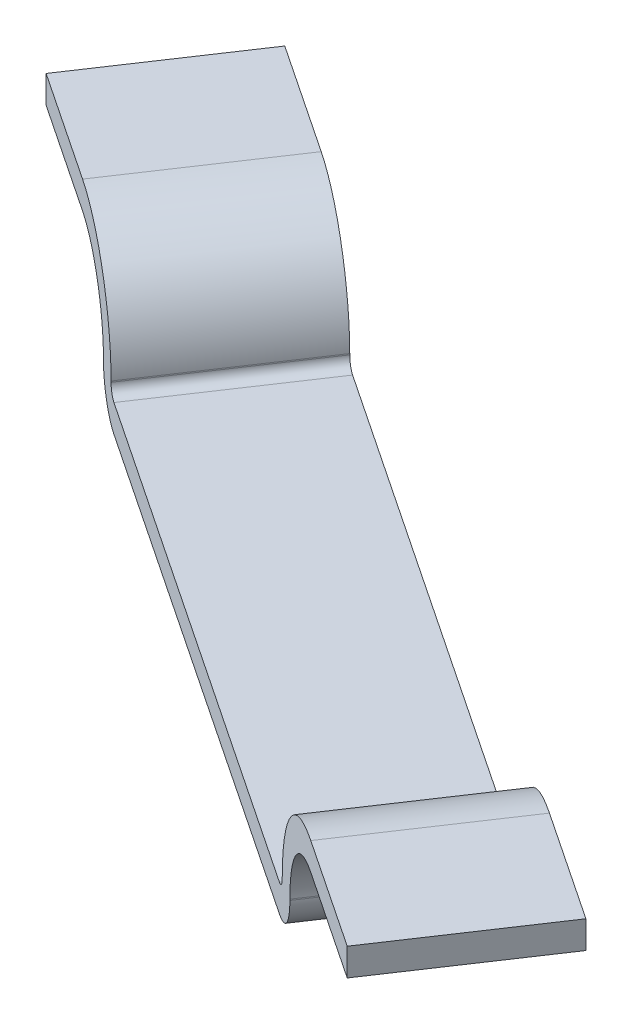
ISO-10303-21;
HEADER;
FILE_DESCRIPTION(('STEP AP214'),'2;1');
FILE_NAME('part.step','',(''),(''),'','','');
FILE_SCHEMA(('AUTOMOTIVE_DESIGN { 1 0 10303 214 1 1 1 1 }'));
ENDSEC;
DATA;
#1=APPLICATION_CONTEXT('core data for automotive mechanical design processes');
#2=APPLICATION_PROTOCOL_DEFINITION('international standard','automotive_design',2000,#1);
#3=PRODUCT_CONTEXT('',#1,'mechanical');
#4=PRODUCT('Part','Part','',(#3));
#5=PRODUCT_RELATED_PRODUCT_CATEGORY('part','',(#4));
#6=PRODUCT_DEFINITION_FORMATION('','',#4);
#7=PRODUCT_DEFINITION_CONTEXT('part definition',#1,'design');
#8=PRODUCT_DEFINITION('design','',#6,#7);
#9=PRODUCT_DEFINITION_SHAPE('','',#8);
#10=(LENGTH_UNIT() NAMED_UNIT(*) SI_UNIT(.MILLI.,.METRE.));
#11=(NAMED_UNIT(*) PLANE_ANGLE_UNIT() SI_UNIT($,.RADIAN.));
#12=(NAMED_UNIT(*) SI_UNIT($,.STERADIAN.) SOLID_ANGLE_UNIT());
#13=UNCERTAINTY_MEASURE_WITH_UNIT(LENGTH_MEASURE(1.E-05),#10,'distance_accuracy_value','');
#14=(GEOMETRIC_REPRESENTATION_CONTEXT(3) GLOBAL_UNCERTAINTY_ASSIGNED_CONTEXT((#13)) GLOBAL_UNIT_ASSIGNED_CONTEXT((#10,
#11,#12)) REPRESENTATION_CONTEXT('',''));
#15=CARTESIAN_POINT('',(0.,0.,0.));
#16=DIRECTION('',(0.,0.,1.));
#17=DIRECTION('',(1.,0.,0.));
#18=AXIS2_PLACEMENT_3D('',#15,#16,#17);
#19=CARTESIAN_POINT('',(-63.4705789838044,293.912651075744,-75.0206461074792));
#20=DIRECTION('',(-0.831624490182753,0.,-0.555338371921368));
#21=DIRECTION('',(-0.555338371921368,0.,0.831624490182753));
#22=AXIS2_PLACEMENT_3D('',#19,#20,#21);
#23=PLANE('',#22);
#24=DIRECTION('',(0.,-1.,0.));
#25=VECTOR('',#24,1.);
#26=CARTESIAN_POINT('',(-59.3055411943941,293.912651075744,-81.2578297838499));
#27=LINE('',#26,#25);
#28=CARTESIAN_POINT('',(-59.3055411943941,293.912651075744,-81.2578297838499));
#29=VERTEX_POINT('',#28);
#30=CARTESIAN_POINT('',(-59.3055411943941,292.712651075744,-81.2578297838499));
#31=VERTEX_POINT('',#30);
#32=EDGE_CURVE('E11',#29,#31,#27,.T.);
#33=ORIENTED_EDGE('',*,*,#32,.T.);
#34=DIRECTION('',(0.555338371921368,0.,-0.831624490182753));
#35=VECTOR('',#34,1.);
#36=CARTESIAN_POINT('',(-63.4705789838044,292.712651075744,-75.0206461074792));
#37=LINE('',#36,#35);
#38=CARTESIAN_POINT('',(-63.4705789838044,292.712651075744,-75.0206461074792));
#39=VERTEX_POINT('',#38);
#40=EDGE_CURVE('E37',#39,#31,#37,.T.);
#41=ORIENTED_EDGE('',*,*,#40,.F.);
#42=DIRECTION('',(0.,-1.,0.));
#43=VECTOR('',#42,1.);
#44=CARTESIAN_POINT('',(-63.4705789838044,293.912651075744,-75.0206461074792));
#45=LINE('',#44,#43);
#46=CARTESIAN_POINT('',(-63.4705789838044,293.912651075744,-75.0206461074792));
#47=VERTEX_POINT('',#46);
#48=EDGE_CURVE('E335',#47,#39,#45,.T.);
#49=ORIENTED_EDGE('',*,*,#48,.F.);
#50=DIRECTION('',(0.555338371921368,0.,-0.831624490182753));
#51=VECTOR('',#50,1.);
#52=CARTESIAN_POINT('',(-63.4705789838044,293.912651075744,-75.0206461074792));
#53=LINE('',#52,#51);
#54=EDGE_CURVE('E28',#47,#29,#53,.T.);
#55=ORIENTED_EDGE('',*,*,#54,.T.);
#56=EDGE_LOOP('',(#33,#41,#49,#55));
#57=FACE_BOUND('',#56,.T.);
#58=ADVANCED_FACE('F17',(#57),#23,.T.);
#59=CARTESIAN_POINT('',(-23.9684157001236,293.912651075744,-48.6420734412142));
#60=DIRECTION('',(-0.555338371921368,0.,0.831624490182753));
#61=DIRECTION('',(0.831624490182753,0.,0.555338371921368));
#62=AXIS2_PLACEMENT_3D('',#59,#60,#61);
#63=PLANE('',#62);
#64=DIRECTION('',(-0.831624490182753,0.,-0.555338371921368));
#65=VECTOR('',#64,1.);
#66=CARTESIAN_POINT('',(-23.9684157001236,293.912651075744,-48.6420734412142));
#67=LINE('',#66,#65);
#68=CARTESIAN_POINT('',(-23.9684157001236,293.912651075744,-48.6420734412142));
#69=VERTEX_POINT('',#68);
#70=CARTESIAN_POINT('',(-28.7502565186744,293.912651075744,-51.8352690797621));
#71=VERTEX_POINT('',#70);
#72=EDGE_CURVE('E443',#69,#71,#67,.T.);
#73=ORIENTED_EDGE('',*,*,#72,.T.);
#74=CARTESIAN_POINT('',(-28.7502565186744,289.412651075744,-51.8352690797621));
#75=DIRECTION('',(-0.555338371921368,0.,0.831624490182753));
#76=DIRECTION('',(0.831624490182754,0.,0.555338371921368));
#77=AXIS2_PLACEMENT_3D('',#74,#75,#76);
#78=CIRCLE('',#77,4.5);
#79=CARTESIAN_POINT('',(-32.4925667244968,289.412651075744,-54.3342917534083));
#80=VERTEX_POINT('',#79);
#81=EDGE_CURVE('E439',#71,#80,#78,.T.);
#82=ORIENTED_EDGE('',*,*,#81,.T.);
#83=DIRECTION('',(0.,-1.,0.));
#84=VECTOR('',#83,1.);
#85=CARTESIAN_POINT('',(-32.4925667244968,289.412651075744,-54.3342917534083));
#86=LINE('',#85,#84);
#87=CARTESIAN_POINT('',(-32.4925667244968,289.362651075744,-54.3342917534083));
#88=VERTEX_POINT('',#87);
#89=EDGE_CURVE('E436',#80,#88,#86,.T.);
#90=ORIENTED_EDGE('',*,*,#89,.T.);
#91=CARTESIAN_POINT('',(-32.8667977450791,289.362651075744,-54.5841940207729));
#92=DIRECTION('',(0.555338371921368,0.,-0.831624490182753));
#93=DIRECTION('',(0.831624490182754,0.,0.555338371921368));
#94=AXIS2_PLACEMENT_3D('',#91,#92,#93);
#95=CIRCLE('',#94,0.45);
#96=CARTESIAN_POINT('',(-32.8667977450791,288.912651075744,-54.5841940207729));
#97=VERTEX_POINT('',#96);
#98=EDGE_CURVE('E175',#88,#97,#95,.T.);
#99=ORIENTED_EDGE('',*,*,#98,.T.);
#100=DIRECTION('',(-0.831624490182753,0.,-0.555338371921368));
#101=VECTOR('',#100,1.);
#102=CARTESIAN_POINT('',(-32.8667977450791,288.912651075744,-54.5841940207729));
#103=LINE('',#102,#101);
#104=CARTESIAN_POINT('',(-54.5721969388489,288.912651075744,-69.0785255279206));
#105=VERTEX_POINT('',#104);
#106=EDGE_CURVE('E430',#97,#105,#103,.T.);
#107=ORIENTED_EDGE('',*,*,#106,.T.);
#108=CARTESIAN_POINT('',(-54.5721969388489,289.362651075744,-69.0785255279206));
#109=DIRECTION('',(0.555338371921368,0.,-0.831624490182753));
#110=DIRECTION('',(0.831624490182754,0.,0.555338371921368));
#111=AXIS2_PLACEMENT_3D('',#108,#109,#110);
#112=CIRCLE('',#111,0.45);
#113=CARTESIAN_POINT('',(-54.9464279594312,289.362651075744,-69.3284277952852));
#114=VERTEX_POINT('',#113);
#115=EDGE_CURVE('E426',#105,#114,#112,.T.);
#116=ORIENTED_EDGE('',*,*,#115,.T.);
#117=DIRECTION('',(0.,1.,0.));
#118=VECTOR('',#117,1.);
#119=CARTESIAN_POINT('',(-54.9464279594312,289.362651075744,-69.3284277952852));
#120=LINE('',#119,#118);
#121=CARTESIAN_POINT('',(-54.9464279594312,289.412651075744,-69.3284277952852));
#122=VERTEX_POINT('',#121);
#123=EDGE_CURVE('E422',#114,#122,#120,.T.);
#124=ORIENTED_EDGE('',*,*,#123,.T.);
#125=CARTESIAN_POINT('',(-58.6887381652536,289.412651075744,-71.8274504689314));
#126=DIRECTION('',(-0.555338371921368,0.,0.831624490182753));
#127=DIRECTION('',(0.831624490182754,0.,0.555338371921368));
#128=AXIS2_PLACEMENT_3D('',#125,#126,#127);
#129=CIRCLE('',#128,4.5);
#130=CARTESIAN_POINT('',(-58.6887381652536,293.912651075744,-71.8274504689314));
#131=VERTEX_POINT('',#130);
#132=EDGE_CURVE('E418',#122,#131,#129,.T.);
#133=ORIENTED_EDGE('',*,*,#132,.T.);
#134=DIRECTION('',(-0.831624490182753,0.,-0.555338371921368));
#135=VECTOR('',#134,1.);
#136=CARTESIAN_POINT('',(-58.6887381652536,293.912651075744,-71.8274504689314));
#137=LINE('',#136,#135);
#138=EDGE_CURVE('E386',#131,#47,#137,.T.);
#139=ORIENTED_EDGE('',*,*,#138,.T.);
#140=ORIENTED_EDGE('',*,*,#48,.T.);
#141=DIRECTION('',(-0.831624490182753,0.,-0.555338371921368));
#142=VECTOR('',#141,1.);
#143=CARTESIAN_POINT('',(-58.6887381652536,292.712651075744,-71.8274504689314));
#144=LINE('',#143,#142);
#145=CARTESIAN_POINT('',(-58.6887381652536,292.712651075744,-71.8274504689314));
#146=VERTEX_POINT('',#145);
#147=EDGE_CURVE('E266',#146,#39,#144,.T.);
#148=ORIENTED_EDGE('',*,*,#147,.F.);
#149=CARTESIAN_POINT('',(-58.6887381652536,289.412651075744,-71.8274504689314));
#150=DIRECTION('',(-0.555338371921368,0.,0.831624490182753));
#151=DIRECTION('',(-0.831624490182754,0.,-0.555338371921368));
#152=AXIS2_PLACEMENT_3D('',#149,#150,#151);
#153=CIRCLE('',#152,3.3);
#154=CARTESIAN_POINT('',(-55.9443773476505,289.412651075744,-69.9948338415908));
#155=VERTEX_POINT('',#154);
#156=EDGE_CURVE('E262',#155,#146,#153,.T.);
#157=ORIENTED_EDGE('',*,*,#156,.F.);
#158=DIRECTION('',(0.,1.,0.));
#159=VECTOR('',#158,1.);
#160=CARTESIAN_POINT('',(-55.9443773476505,289.362651075744,-69.9948338415908));
#161=LINE('',#160,#159);
#162=CARTESIAN_POINT('',(-55.9443773476505,289.362651075744,-69.9948338415908));
#163=VERTEX_POINT('',#162);
#164=EDGE_CURVE('E257',#163,#155,#161,.T.);
#165=ORIENTED_EDGE('',*,*,#164,.F.);
#166=CARTESIAN_POINT('',(-54.5721969388489,289.362651075744,-69.0785255279206));
#167=DIRECTION('',(0.555338371921368,0.,-0.831624490182753));
#168=DIRECTION('',(-0.831624490182754,0.,-0.555338371921368));
#169=AXIS2_PLACEMENT_3D('',#166,#167,#168);
#170=CIRCLE('',#169,1.65);
#171=CARTESIAN_POINT('',(-54.5721969388489,287.712651075744,-69.0785255279206));
#172=VERTEX_POINT('',#171);
#173=EDGE_CURVE('E252',#172,#163,#170,.T.);
#174=ORIENTED_EDGE('',*,*,#173,.F.);
#175=DIRECTION('',(-0.831624490182753,0.,-0.555338371921368));
#176=VECTOR('',#175,1.);
#177=CARTESIAN_POINT('',(-32.8667977450791,287.712651075744,-54.5841940207729));
#178=LINE('',#177,#176);
#179=CARTESIAN_POINT('',(-32.8667977450791,287.712651075744,-54.5841940207729));
#180=VERTEX_POINT('',#179);
#181=EDGE_CURVE('E247',#180,#172,#178,.T.);
#182=ORIENTED_EDGE('',*,*,#181,.F.);
#183=CARTESIAN_POINT('',(-32.8667977450791,289.362651075744,-54.5841940207729));
#184=DIRECTION('',(0.555338371921368,0.,-0.831624490182753));
#185=DIRECTION('',(-0.831624490182754,0.,-0.555338371921368));
#186=AXIS2_PLACEMENT_3D('',#183,#184,#185);
#187=CIRCLE('',#186,1.65);
#188=CARTESIAN_POINT('',(-31.4946173362775,289.362651075744,-53.6678857071026));
#189=VERTEX_POINT('',#188);
#190=EDGE_CURVE('E242',#189,#180,#187,.T.);
#191=ORIENTED_EDGE('',*,*,#190,.F.);
#192=DIRECTION('',(0.,-1.,0.));
#193=VECTOR('',#192,1.);
#194=CARTESIAN_POINT('',(-31.4946173362775,289.412651075744,-53.6678857071026));
#195=LINE('',#194,#193);
#196=CARTESIAN_POINT('',(-31.4946173362775,289.412651075744,-53.6678857071026));
#197=VERTEX_POINT('',#196);
#198=EDGE_CURVE('E237',#197,#189,#195,.T.);
#199=ORIENTED_EDGE('',*,*,#198,.F.);
#200=CARTESIAN_POINT('',(-28.7502565186744,289.412651075744,-51.8352690797621));
#201=DIRECTION('',(-0.555338371921368,0.,0.831624490182753));
#202=DIRECTION('',(-0.831624490182754,0.,-0.555338371921368));
#203=AXIS2_PLACEMENT_3D('',#200,#201,#202);
#204=CIRCLE('',#203,3.3);
#205=CARTESIAN_POINT('',(-28.7502565186744,292.712651075744,-51.8352690797621));
#206=VERTEX_POINT('',#205);
#207=EDGE_CURVE('E232',#206,#197,#204,.T.);
#208=ORIENTED_EDGE('',*,*,#207,.F.);
#209=DIRECTION('',(-0.831624490182753,0.,-0.555338371921368));
#210=VECTOR('',#209,1.);
#211=CARTESIAN_POINT('',(-23.9684157001236,292.712651075744,-48.6420734412142));
#212=LINE('',#211,#210);
#213=CARTESIAN_POINT('',(-23.9684157001236,292.712651075744,-48.6420734412142));
#214=VERTEX_POINT('',#213);
#215=EDGE_CURVE('E231',#214,#206,#212,.T.);
#216=ORIENTED_EDGE('',*,*,#215,.F.);
#217=DIRECTION('',(0.,-1.,0.));
#218=VECTOR('',#217,1.);
#219=CARTESIAN_POINT('',(-23.9684157001236,293.912651075744,-48.6420734412142));
#220=LINE('',#219,#218);
#221=EDGE_CURVE('E331',#69,#214,#220,.T.);
#222=ORIENTED_EDGE('',*,*,#221,.F.);
#223=EDGE_LOOP('',(#73,#82,#90,#99,#107,#116,#124,#133,#139,#140,#148,#157,#165,#174,#182,#191,
#199,#208,#216,#222));
#224=FACE_BOUND('',#223,.T.);
#225=ADVANCED_FACE('F452',(#224),#63,.T.);
#226=CARTESIAN_POINT('',(-23.9684157001236,293.912651075744,-48.6420734412142));
#227=DIRECTION('',(-0.831624490182753,0.,-0.555338371921368));
#228=DIRECTION('',(-0.555338371921368,0.,0.831624490182753));
#229=AXIS2_PLACEMENT_3D('',#226,#227,#228);
#230=PLANE('',#229);
#231=ORIENTED_EDGE('',*,*,#221,.T.);
#232=DIRECTION('',(0.555338371921368,0.,-0.831624490182753));
#233=VECTOR('',#232,1.);
#234=CARTESIAN_POINT('',(-23.9684157001236,292.712651075744,-48.6420734412142));
#235=LINE('',#234,#233);
#236=CARTESIAN_POINT('',(-19.8033779107134,292.712651075744,-54.8792571175849));
#237=VERTEX_POINT('',#236);
#238=EDGE_CURVE('E336',#214,#237,#235,.T.);
#239=ORIENTED_EDGE('',*,*,#238,.T.);
#240=DIRECTION('',(0.,-1.,0.));
#241=VECTOR('',#240,1.);
#242=CARTESIAN_POINT('',(-19.8033779107134,293.912651075744,-54.8792571175849));
#243=LINE('',#242,#241);
#244=CARTESIAN_POINT('',(-19.8033779107134,293.912651075744,-54.8792571175849));
#245=VERTEX_POINT('',#244);
#246=EDGE_CURVE('E289',#245,#237,#243,.T.);
#247=ORIENTED_EDGE('',*,*,#246,.F.);
#248=DIRECTION('',(0.555338371921368,0.,-0.831624490182753));
#249=VECTOR('',#248,1.);
#250=CARTESIAN_POINT('',(-23.9684157001236,293.912651075744,-48.6420734412142));
#251=LINE('',#250,#249);
#252=EDGE_CURVE('E274',#69,#245,#251,.T.);
#253=ORIENTED_EDGE('',*,*,#252,.F.);
#254=EDGE_LOOP('',(#231,#239,#247,#253));
#255=FACE_BOUND('',#254,.T.);
#256=ADVANCED_FACE('F346',(#255),#230,.F.);
#257=CARTESIAN_POINT('',(-24.5852187292642,289.412651075744,-58.0724527561328));
#258=DIRECTION('',(0.555338371921368,0.,-0.831624490182753));
#259=DIRECTION('',(0.831624490182753,0.,0.555338371921368));
#260=AXIS2_PLACEMENT_3D('',#257,#258,#259);
#261=PLANE('',#260);
#262=CARTESIAN_POINT('',(-24.5852187292642,289.412651075744,-58.0724527561328));
#263=DIRECTION('',(-0.555338371921368,0.,0.831624490182753));
#264=DIRECTION('',(0.831624490182754,0.,0.555338371921368));
#265=AXIS2_PLACEMENT_3D('',#262,#263,#264);
#266=CIRCLE('',#265,4.5);
#267=CARTESIAN_POINT('',(-24.5852187292642,293.912651075744,-58.0724527561328));
#268=VERTEX_POINT('',#267);
#269=CARTESIAN_POINT('',(-28.3275289350866,289.412651075744,-60.5714754297789));
#270=VERTEX_POINT('',#269);
#271=EDGE_CURVE('E269',#268,#270,#266,.T.);
#272=ORIENTED_EDGE('',*,*,#271,.F.);
#273=DIRECTION('',(-0.831624490182753,0.,-0.555338371921368));
#274=VECTOR('',#273,1.);
#275=CARTESIAN_POINT('',(-19.8033779107134,293.912651075744,-54.8792571175849));
#276=LINE('',#275,#274);
#277=EDGE_CURVE('E278',#245,#268,#276,.T.);
#278=ORIENTED_EDGE('',*,*,#277,.F.);
#279=ORIENTED_EDGE('',*,*,#246,.T.);
#280=DIRECTION('',(-0.831624490182753,0.,-0.555338371921368));
#281=VECTOR('',#280,1.);
#282=CARTESIAN_POINT('',(-19.8033779107134,292.712651075744,-54.8792571175849));
#283=LINE('',#282,#281);
#284=CARTESIAN_POINT('',(-24.5852187292642,292.712651075744,-58.0724527561328));
#285=VERTEX_POINT('',#284);
#286=EDGE_CURVE('E285',#237,#285,#283,.T.);
#287=ORIENTED_EDGE('',*,*,#286,.T.);
#288=CARTESIAN_POINT('',(-24.5852187292642,289.412651075744,-58.0724527561328));
#289=DIRECTION('',(-0.555338371921368,0.,0.831624490182753));
#290=DIRECTION('',(-0.831624490182754,0.,-0.555338371921368));
#291=AXIS2_PLACEMENT_3D('',#288,#289,#290);
#292=CIRCLE('',#291,3.3);
#293=CARTESIAN_POINT('',(-27.3295795468673,289.412651075744,-59.9050693834733));
#294=VERTEX_POINT('',#293);
#295=EDGE_CURVE('E290',#285,#294,#292,.T.);
#296=ORIENTED_EDGE('',*,*,#295,.T.);
#297=DIRECTION('',(0.,-1.,0.));
#298=VECTOR('',#297,1.);
#299=CARTESIAN_POINT('',(-27.3295795468673,289.412651075744,-59.9050693834733));
#300=LINE('',#299,#298);
#301=CARTESIAN_POINT('',(-27.3295795468673,289.362651075744,-59.9050693834733));
#302=VERTEX_POINT('',#301);
#303=EDGE_CURVE('E294',#294,#302,#300,.T.);
#304=ORIENTED_EDGE('',*,*,#303,.T.);
#305=CARTESIAN_POINT('',(-28.7017599556688,289.362651075744,-60.8213776971435));
#306=DIRECTION('',(0.555338371921368,0.,-0.831624490182753));
#307=DIRECTION('',(-0.831624490182754,0.,-0.555338371921368));
#308=AXIS2_PLACEMENT_3D('',#305,#306,#307);
#309=CIRCLE('',#308,1.65);
#310=CARTESIAN_POINT('',(-28.7017599556688,287.712651075744,-60.8213776971435));
#311=VERTEX_POINT('',#310);
#312=EDGE_CURVE('E298',#302,#311,#309,.T.);
#313=ORIENTED_EDGE('',*,*,#312,.T.);
#314=DIRECTION('',(-0.831624490182753,0.,-0.555338371921368));
#315=VECTOR('',#314,1.);
#316=CARTESIAN_POINT('',(-28.7017599556688,287.712651075744,-60.8213776971435));
#317=LINE('',#316,#315);
#318=CARTESIAN_POINT('',(-50.4071591494387,287.712651075744,-75.3157092042912));
#319=VERTEX_POINT('',#318);
#320=EDGE_CURVE('E302',#311,#319,#317,.T.);
#321=ORIENTED_EDGE('',*,*,#320,.T.);
#322=CARTESIAN_POINT('',(-50.4071591494387,289.362651075744,-75.3157092042912));
#323=DIRECTION('',(0.555338371921368,0.,-0.831624490182753));
#324=DIRECTION('',(-0.831624490182754,0.,-0.555338371921368));
#325=AXIS2_PLACEMENT_3D('',#322,#323,#324);
#326=CIRCLE('',#325,1.65);
#327=CARTESIAN_POINT('',(-51.7793395582402,289.362651075744,-76.2320175179615));
#328=VERTEX_POINT('',#327);
#329=EDGE_CURVE('E306',#319,#328,#326,.T.);
#330=ORIENTED_EDGE('',*,*,#329,.T.);
#331=DIRECTION('',(0.,1.,0.));
#332=VECTOR('',#331,1.);
#333=CARTESIAN_POINT('',(-51.7793395582402,289.362651075744,-76.2320175179615));
#334=LINE('',#333,#332);
#335=CARTESIAN_POINT('',(-51.7793395582402,289.412651075744,-76.2320175179615));
#336=VERTEX_POINT('',#335);
#337=EDGE_CURVE('E310',#328,#336,#334,.T.);
#338=ORIENTED_EDGE('',*,*,#337,.T.);
#339=CARTESIAN_POINT('',(-54.5237003758433,289.412651075744,-78.064634145302));
#340=DIRECTION('',(-0.555338371921368,0.,0.831624490182753));
#341=DIRECTION('',(-0.831624490182754,0.,-0.555338371921368));
#342=AXIS2_PLACEMENT_3D('',#339,#340,#341);
#343=CIRCLE('',#342,3.3);
#344=CARTESIAN_POINT('',(-54.5237003758433,292.712651075744,-78.064634145302));
#345=VERTEX_POINT('',#344);
#346=EDGE_CURVE('E313',#336,#345,#343,.T.);
#347=ORIENTED_EDGE('',*,*,#346,.T.);
#348=DIRECTION('',(-0.831624490182753,0.,-0.555338371921368));
#349=VECTOR('',#348,1.);
#350=CARTESIAN_POINT('',(-54.5237003758433,292.712651075744,-78.064634145302));
#351=LINE('',#350,#349);
#352=EDGE_CURVE('E218',#345,#31,#351,.T.);
#353=ORIENTED_EDGE('',*,*,#352,.T.);
#354=ORIENTED_EDGE('',*,*,#32,.F.);
#355=DIRECTION('',(-0.831624490182753,0.,-0.555338371921368));
#356=VECTOR('',#355,1.);
#357=CARTESIAN_POINT('',(-54.5237003758433,293.912651075744,-78.064634145302));
#358=LINE('',#357,#356);
#359=CARTESIAN_POINT('',(-54.5237003758433,293.912651075744,-78.064634145302));
#360=VERTEX_POINT('',#359);
#361=EDGE_CURVE('E202',#360,#29,#358,.T.);
#362=ORIENTED_EDGE('',*,*,#361,.F.);
#363=CARTESIAN_POINT('',(-54.5237003758433,289.412651075744,-78.064634145302));
#364=DIRECTION('',(-0.555338371921368,0.,0.831624490182753));
#365=DIRECTION('',(0.831624490182754,0.,0.555338371921368));
#366=AXIS2_PLACEMENT_3D('',#363,#364,#365);
#367=CIRCLE('',#366,4.5);
#368=CARTESIAN_POINT('',(-50.7813901700209,289.412651075744,-75.5656114716559));
#369=VERTEX_POINT('',#368);
#370=EDGE_CURVE('E198',#369,#360,#367,.T.);
#371=ORIENTED_EDGE('',*,*,#370,.F.);
#372=DIRECTION('',(0.,1.,0.));
#373=VECTOR('',#372,1.);
#374=CARTESIAN_POINT('',(-50.7813901700209,289.362651075744,-75.5656114716559));
#375=LINE('',#374,#373);
#376=CARTESIAN_POINT('',(-50.7813901700209,289.362651075744,-75.5656114716559));
#377=VERTEX_POINT('',#376);
#378=EDGE_CURVE('E194',#377,#369,#375,.T.);
#379=ORIENTED_EDGE('',*,*,#378,.F.);
#380=CARTESIAN_POINT('',(-50.4071591494387,289.362651075744,-75.3157092042912));
#381=DIRECTION('',(0.555338371921368,0.,-0.831624490182753));
#382=DIRECTION('',(0.831624490182754,0.,0.555338371921368));
#383=AXIS2_PLACEMENT_3D('',#380,#381,#382);
#384=CIRCLE('',#383,0.45);
#385=CARTESIAN_POINT('',(-50.4071591494387,288.912651075744,-75.3157092042912));
#386=VERTEX_POINT('',#385);
#387=EDGE_CURVE('E189',#386,#377,#384,.T.);
#388=ORIENTED_EDGE('',*,*,#387,.F.);
#389=DIRECTION('',(-0.831624490182753,0.,-0.555338371921368));
#390=VECTOR('',#389,1.);
#391=CARTESIAN_POINT('',(-28.7017599556688,288.912651075744,-60.8213776971435));
#392=LINE('',#391,#390);
#393=CARTESIAN_POINT('',(-28.7017599556688,288.912651075744,-60.8213776971435));
#394=VERTEX_POINT('',#393);
#395=EDGE_CURVE('E150',#394,#386,#392,.T.);
#396=ORIENTED_EDGE('',*,*,#395,.F.);
#397=CARTESIAN_POINT('',(-28.7017599556688,289.362651075744,-60.8213776971435));
#398=DIRECTION('',(0.555338371921368,0.,-0.831624490182753));
#399=DIRECTION('',(0.831624490182754,0.,0.555338371921368));
#400=AXIS2_PLACEMENT_3D('',#397,#398,#399);
#401=CIRCLE('',#400,0.45);
#402=CARTESIAN_POINT('',(-28.3275289350866,289.362651075744,-60.5714754297789));
#403=VERTEX_POINT('',#402);
#404=EDGE_CURVE('E152',#403,#394,#401,.T.);
#405=ORIENTED_EDGE('',*,*,#404,.F.);
#406=DIRECTION('',(0.,-1.,0.));
#407=VECTOR('',#406,1.);
#408=CARTESIAN_POINT('',(-28.3275289350866,289.412651075744,-60.5714754297789));
#409=LINE('',#408,#407);
#410=EDGE_CURVE('E155',#270,#403,#409,.T.);
#411=ORIENTED_EDGE('',*,*,#410,.F.);
#412=EDGE_LOOP('',(#272,#278,#279,#287,#296,#304,#313,#321,#330,#338,#347,#353,#354,#362,#371,
#379,#388,#396,#405,#411));
#413=FACE_BOUND('',#412,.T.);
#414=ADVANCED_FACE('F154',(#413),#261,.T.);
#415=CARTESIAN_POINT('',(-23.9684157001236,292.712651075744,-48.6420734412142));
#416=DIRECTION('',(0.,-1.,0.));
#417=DIRECTION('',(-0.555338371921368,0.,0.831624490182753));
#418=AXIS2_PLACEMENT_3D('',#415,#416,#417);
#419=PLANE('',#418);
#420=ORIENTED_EDGE('',*,*,#286,.F.);
#421=ORIENTED_EDGE('',*,*,#238,.F.);
#422=ORIENTED_EDGE('',*,*,#215,.T.);
#423=DIRECTION('',(0.555338371921368,0.,-0.831624490182753));
#424=VECTOR('',#423,1.);
#425=CARTESIAN_POINT('',(-28.7502565186744,292.712651075744,-51.8352690797621));
#426=LINE('',#425,#424);
#427=EDGE_CURVE('E227',#206,#285,#426,.T.);
#428=ORIENTED_EDGE('',*,*,#427,.T.);
#429=EDGE_LOOP('',(#420,#421,#422,#428));
#430=FACE_BOUND('',#429,.T.);
#431=ADVANCED_FACE('F347',(#430),#419,.T.);
#432=CARTESIAN_POINT('',(-28.7502565186744,289.412651075744,-51.8352690797621));
#433=DIRECTION('',(0.555338371921368,0.,-0.831624490182753));
#434=DIRECTION('',(0.831624490182753,0.,0.555338371921368));
#435=AXIS2_PLACEMENT_3D('',#432,#433,#434);
#436=CYLINDRICAL_SURFACE('',#435,3.3);
#437=ORIENTED_EDGE('',*,*,#295,.F.);
#438=ORIENTED_EDGE('',*,*,#427,.F.);
#439=ORIENTED_EDGE('',*,*,#207,.T.);
#440=DIRECTION('',(0.555338371921368,0.,-0.831624490182753));
#441=VECTOR('',#440,1.);
#442=CARTESIAN_POINT('',(-31.4946173362775,289.412651075744,-53.6678857071026));
#443=LINE('',#442,#441);
#444=EDGE_CURVE('E233',#197,#294,#443,.T.);
#445=ORIENTED_EDGE('',*,*,#444,.T.);
#446=EDGE_LOOP('',(#437,#438,#439,#445));
#447=FACE_BOUND('',#446,.T.);
#448=ADVANCED_FACE('F350',(#447),#436,.F.);
#449=CARTESIAN_POINT('',(-31.4946173362775,289.412651075744,-53.6678857071026));
#450=DIRECTION('',(0.831624490182753,0.,0.555338371921368));
#451=DIRECTION('',(-0.555338371921368,0.,0.831624490182753));
#452=AXIS2_PLACEMENT_3D('',#449,#450,#451);
#453=PLANE('',#452);
#454=ORIENTED_EDGE('',*,*,#303,.F.);
#455=ORIENTED_EDGE('',*,*,#444,.F.);
#456=ORIENTED_EDGE('',*,*,#198,.T.);
#457=DIRECTION('',(0.555338371921368,0.,-0.831624490182753));
#458=VECTOR('',#457,1.);
#459=CARTESIAN_POINT('',(-31.4946173362775,289.362651075744,-53.6678857071026));
#460=LINE('',#459,#458);
#461=EDGE_CURVE('E238',#189,#302,#460,.T.);
#462=ORIENTED_EDGE('',*,*,#461,.T.);
#463=EDGE_LOOP('',(#454,#455,#456,#462));
#464=FACE_BOUND('',#463,.T.);
#465=ADVANCED_FACE('F355',(#464),#453,.T.);
#466=CARTESIAN_POINT('',(-32.8667977450791,289.362651075744,-54.5841940207729));
#467=DIRECTION('',(0.555338371921368,0.,-0.831624490182753));
#468=DIRECTION('',(0.831624490182753,0.,0.555338371921368));
#469=AXIS2_PLACEMENT_3D('',#466,#467,#468);
#470=CYLINDRICAL_SURFACE('',#469,1.65);
#471=ORIENTED_EDGE('',*,*,#312,.F.);
#472=ORIENTED_EDGE('',*,*,#461,.F.);
#473=ORIENTED_EDGE('',*,*,#190,.T.);
#474=DIRECTION('',(0.555338371921368,0.,-0.831624490182753));
#475=VECTOR('',#474,1.);
#476=CARTESIAN_POINT('',(-32.8667977450791,287.712651075744,-54.5841940207729));
#477=LINE('',#476,#475);
#478=EDGE_CURVE('E243',#180,#311,#477,.T.);
#479=ORIENTED_EDGE('',*,*,#478,.T.);
#480=EDGE_LOOP('',(#471,#472,#473,#479));
#481=FACE_BOUND('',#480,.T.);
#482=ADVANCED_FACE('F358',(#481),#470,.T.);
#483=CARTESIAN_POINT('',(-32.8667977450791,287.712651075744,-54.5841940207729));
#484=DIRECTION('',(0.,-1.,0.));
#485=DIRECTION('',(-0.555338371921368,0.,0.831624490182753));
#486=AXIS2_PLACEMENT_3D('',#483,#484,#485);
#487=PLANE('',#486);
#488=ORIENTED_EDGE('',*,*,#320,.F.);
#489=ORIENTED_EDGE('',*,*,#478,.F.);
#490=ORIENTED_EDGE('',*,*,#181,.T.);
#491=DIRECTION('',(0.555338371921368,0.,-0.831624490182753));
#492=VECTOR('',#491,1.);
#493=CARTESIAN_POINT('',(-54.5721969388489,287.712651075744,-69.0785255279206));
#494=LINE('',#493,#492);
#495=EDGE_CURVE('E248',#172,#319,#494,.T.);
#496=ORIENTED_EDGE('',*,*,#495,.T.);
#497=EDGE_LOOP('',(#488,#489,#490,#496));
#498=FACE_BOUND('',#497,.T.);
#499=ADVANCED_FACE('F362',(#498),#487,.T.);
#500=CARTESIAN_POINT('',(-54.5721969388489,289.362651075744,-69.0785255279206));
#501=DIRECTION('',(0.555338371921368,0.,-0.831624490182753));
#502=DIRECTION('',(0.831624490182753,0.,0.555338371921368));
#503=AXIS2_PLACEMENT_3D('',#500,#501,#502);
#504=CYLINDRICAL_SURFACE('',#503,1.65);
#505=ORIENTED_EDGE('',*,*,#329,.F.);
#506=ORIENTED_EDGE('',*,*,#495,.F.);
#507=ORIENTED_EDGE('',*,*,#173,.T.);
#508=DIRECTION('',(0.555338371921368,0.,-0.831624490182753));
#509=VECTOR('',#508,1.);
#510=CARTESIAN_POINT('',(-55.9443773476505,289.362651075744,-69.9948338415908));
#511=LINE('',#510,#509);
#512=EDGE_CURVE('E253',#163,#328,#511,.T.);
#513=ORIENTED_EDGE('',*,*,#512,.T.);
#514=EDGE_LOOP('',(#505,#506,#507,#513));
#515=FACE_BOUND('',#514,.T.);
#516=ADVANCED_FACE('F367',(#515),#504,.T.);
#517=CARTESIAN_POINT('',(-55.9443773476505,289.362651075744,-69.9948338415908));
#518=DIRECTION('',(-0.831624490182753,0.,-0.555338371921368));
#519=DIRECTION('',(0.555338371921368,0.,-0.831624490182753));
#520=AXIS2_PLACEMENT_3D('',#517,#518,#519);
#521=PLANE('',#520);
#522=ORIENTED_EDGE('',*,*,#337,.F.);
#523=ORIENTED_EDGE('',*,*,#512,.F.);
#524=ORIENTED_EDGE('',*,*,#164,.T.);
#525=DIRECTION('',(0.555338371921368,0.,-0.831624490182753));
#526=VECTOR('',#525,1.);
#527=CARTESIAN_POINT('',(-55.9443773476505,289.412651075744,-69.9948338415908));
#528=LINE('',#527,#526);
#529=EDGE_CURVE('E258',#155,#336,#528,.T.);
#530=ORIENTED_EDGE('',*,*,#529,.T.);
#531=EDGE_LOOP('',(#522,#523,#524,#530));
#532=FACE_BOUND('',#531,.T.);
#533=ADVANCED_FACE('F370',(#532),#521,.T.);
#534=CARTESIAN_POINT('',(-58.6887381652536,289.412651075744,-71.8274504689314));
#535=DIRECTION('',(0.555338371921368,0.,-0.831624490182753));
#536=DIRECTION('',(0.831624490182753,0.,0.555338371921368));
#537=AXIS2_PLACEMENT_3D('',#534,#535,#536);
#538=CYLINDRICAL_SURFACE('',#537,3.3);
#539=ORIENTED_EDGE('',*,*,#346,.F.);
#540=ORIENTED_EDGE('',*,*,#529,.F.);
#541=ORIENTED_EDGE('',*,*,#156,.T.);
#542=DIRECTION('',(0.555338371921368,0.,-0.831624490182753));
#543=VECTOR('',#542,1.);
#544=CARTESIAN_POINT('',(-58.6887381652536,292.712651075744,-71.8274504689314));
#545=LINE('',#544,#543);
#546=EDGE_CURVE('E263',#146,#345,#545,.T.);
#547=ORIENTED_EDGE('',*,*,#546,.T.);
#548=EDGE_LOOP('',(#539,#540,#541,#547));
#549=FACE_BOUND('',#548,.T.);
#550=ADVANCED_FACE('F374',(#549),#538,.F.);
#551=CARTESIAN_POINT('',(-58.6887381652536,292.712651075744,-71.8274504689314));
#552=DIRECTION('',(0.,-1.,0.));
#553=DIRECTION('',(-0.831624490182753,0.,-0.555338371921368));
#554=AXIS2_PLACEMENT_3D('',#551,#552,#553);
#555=PLANE('',#554);
#556=ORIENTED_EDGE('',*,*,#352,.F.);
#557=ORIENTED_EDGE('',*,*,#546,.F.);
#558=ORIENTED_EDGE('',*,*,#147,.T.);
#559=ORIENTED_EDGE('',*,*,#40,.T.);
#560=EDGE_LOOP('',(#556,#557,#558,#559));
#561=FACE_BOUND('',#560,.T.);
#562=ADVANCED_FACE('F376',(#561),#555,.T.);
#563=CARTESIAN_POINT('',(-23.9684157001236,293.912651075744,-48.6420734412142));
#564=DIRECTION('',(0.,-1.,0.));
#565=DIRECTION('',(-0.555338371921368,0.,0.831624490182753));
#566=AXIS2_PLACEMENT_3D('',#563,#564,#565);
#567=PLANE('',#566);
#568=ORIENTED_EDGE('',*,*,#277,.T.);
#569=DIRECTION('',(0.555338371921368,0.,-0.831624490182753));
#570=VECTOR('',#569,1.);
#571=CARTESIAN_POINT('',(-28.7502565186744,293.912651075744,-51.8352690797621));
#572=LINE('',#571,#570);
#573=EDGE_CURVE('E171',#71,#268,#572,.T.);
#574=ORIENTED_EDGE('',*,*,#573,.F.);
#575=ORIENTED_EDGE('',*,*,#72,.F.);
#576=ORIENTED_EDGE('',*,*,#252,.T.);
#577=EDGE_LOOP('',(#568,#574,#575,#576));
#578=FACE_BOUND('',#577,.T.);
#579=ADVANCED_FACE('F471',(#578),#567,.F.);
#580=CARTESIAN_POINT('',(-28.7502565186744,289.412651075744,-51.8352690797621));
#581=DIRECTION('',(0.555338371921368,0.,-0.831624490182753));
#582=DIRECTION('',(0.831624490182753,0.,0.555338371921368));
#583=AXIS2_PLACEMENT_3D('',#580,#581,#582);
#584=CYLINDRICAL_SURFACE('',#583,4.5);
#585=ORIENTED_EDGE('',*,*,#271,.T.);
#586=DIRECTION('',(0.555338371921368,0.,-0.831624490182753));
#587=VECTOR('',#586,1.);
#588=CARTESIAN_POINT('',(-32.4925667244968,289.412651075744,-54.3342917534083));
#589=LINE('',#588,#587);
#590=EDGE_CURVE('E162',#80,#270,#589,.T.);
#591=ORIENTED_EDGE('',*,*,#590,.F.);
#592=ORIENTED_EDGE('',*,*,#81,.F.);
#593=ORIENTED_EDGE('',*,*,#573,.T.);
#594=EDGE_LOOP('',(#585,#591,#592,#593));
#595=FACE_BOUND('',#594,.T.);
#596=ADVANCED_FACE('F465',(#595),#584,.T.);
#597=CARTESIAN_POINT('',(-32.4925667244968,289.412651075744,-54.3342917534083));
#598=DIRECTION('',(0.831624490182753,0.,0.555338371921368));
#599=DIRECTION('',(-0.555338371921368,0.,0.831624490182753));
#600=AXIS2_PLACEMENT_3D('',#597,#598,#599);
#601=PLANE('',#600);
#602=ORIENTED_EDGE('',*,*,#410,.T.);
#603=DIRECTION('',(0.555338371921368,0.,-0.831624490182753));
#604=VECTOR('',#603,1.);
#605=CARTESIAN_POINT('',(-32.4925667244968,289.362651075744,-54.3342917534083));
#606=LINE('',#605,#604);
#607=EDGE_CURVE('E163',#88,#403,#606,.T.);
#608=ORIENTED_EDGE('',*,*,#607,.F.);
#609=ORIENTED_EDGE('',*,*,#89,.F.);
#610=ORIENTED_EDGE('',*,*,#590,.T.);
#611=EDGE_LOOP('',(#602,#608,#609,#610));
#612=FACE_BOUND('',#611,.T.);
#613=ADVANCED_FACE('F168',(#612),#601,.F.);
#614=CARTESIAN_POINT('',(-32.8667977450791,289.362651075744,-54.5841940207729));
#615=DIRECTION('',(0.555338371921368,0.,-0.831624490182753));
#616=DIRECTION('',(0.831624490182753,0.,0.555338371921368));
#617=AXIS2_PLACEMENT_3D('',#614,#615,#616);
#618=CYLINDRICAL_SURFACE('',#617,0.45);
#619=ORIENTED_EDGE('',*,*,#404,.T.);
#620=DIRECTION('',(0.555338371921368,0.,-0.831624490182753));
#621=VECTOR('',#620,1.);
#622=CARTESIAN_POINT('',(-32.8667977450791,288.912651075744,-54.5841940207729));
#623=LINE('',#622,#621);
#624=EDGE_CURVE('E182',#97,#394,#623,.T.);
#625=ORIENTED_EDGE('',*,*,#624,.F.);
#626=ORIENTED_EDGE('',*,*,#98,.F.);
#627=ORIENTED_EDGE('',*,*,#607,.T.);
#628=EDGE_LOOP('',(#619,#625,#626,#627));
#629=FACE_BOUND('',#628,.T.);
#630=ADVANCED_FACE('F173',(#629),#618,.F.);
#631=CARTESIAN_POINT('',(-32.8667977450791,288.912651075744,-54.5841940207729));
#632=DIRECTION('',(0.,-1.,0.));
#633=DIRECTION('',(-0.555338371921368,0.,0.831624490182753));
#634=AXIS2_PLACEMENT_3D('',#631,#632,#633);
#635=PLANE('',#634);
#636=ORIENTED_EDGE('',*,*,#395,.T.);
#637=DIRECTION('',(0.555338371921368,0.,-0.831624490182753));
#638=VECTOR('',#637,1.);
#639=CARTESIAN_POINT('',(-54.5721969388489,288.912651075744,-69.0785255279206));
#640=LINE('',#639,#638);
#641=EDGE_CURVE('E190',#105,#386,#640,.T.);
#642=ORIENTED_EDGE('',*,*,#641,.F.);
#643=ORIENTED_EDGE('',*,*,#106,.F.);
#644=ORIENTED_EDGE('',*,*,#624,.T.);
#645=EDGE_LOOP('',(#636,#642,#643,#644));
#646=FACE_BOUND('',#645,.T.);
#647=ADVANCED_FACE('F463',(#646),#635,.F.);
#648=CARTESIAN_POINT('',(-54.5721969388489,289.362651075744,-69.0785255279206));
#649=DIRECTION('',(0.555338371921368,0.,-0.831624490182753));
#650=DIRECTION('',(0.831624490182753,0.,0.555338371921368));
#651=AXIS2_PLACEMENT_3D('',#648,#649,#650);
#652=CYLINDRICAL_SURFACE('',#651,0.45);
#653=ORIENTED_EDGE('',*,*,#387,.T.);
#654=DIRECTION('',(0.555338371921368,0.,-0.831624490182753));
#655=VECTOR('',#654,1.);
#656=CARTESIAN_POINT('',(-54.9464279594312,289.362651075744,-69.3284277952852));
#657=LINE('',#656,#655);
#658=EDGE_CURVE('E195',#114,#377,#657,.T.);
#659=ORIENTED_EDGE('',*,*,#658,.F.);
#660=ORIENTED_EDGE('',*,*,#115,.F.);
#661=ORIENTED_EDGE('',*,*,#641,.T.);
#662=EDGE_LOOP('',(#653,#659,#660,#661));
#663=FACE_BOUND('',#662,.T.);
#664=ADVANCED_FACE('F460',(#663),#652,.F.);
#665=CARTESIAN_POINT('',(-54.9464279594312,289.362651075744,-69.3284277952852));
#666=DIRECTION('',(-0.831624490182753,0.,-0.555338371921368));
#667=DIRECTION('',(0.555338371921368,0.,-0.831624490182753));
#668=AXIS2_PLACEMENT_3D('',#665,#666,#667);
#669=PLANE('',#668);
#670=ORIENTED_EDGE('',*,*,#378,.T.);
#671=DIRECTION('',(0.555338371921368,0.,-0.831624490182753));
#672=VECTOR('',#671,1.);
#673=CARTESIAN_POINT('',(-54.9464279594312,289.412651075744,-69.3284277952852));
#674=LINE('',#673,#672);
#675=EDGE_CURVE('E199',#122,#369,#674,.T.);
#676=ORIENTED_EDGE('',*,*,#675,.F.);
#677=ORIENTED_EDGE('',*,*,#123,.F.);
#678=ORIENTED_EDGE('',*,*,#658,.T.);
#679=EDGE_LOOP('',(#670,#676,#677,#678));
#680=FACE_BOUND('',#679,.T.);
#681=ADVANCED_FACE('F457',(#680),#669,.F.);
#682=CARTESIAN_POINT('',(-58.6887381652536,289.412651075744,-71.8274504689314));
#683=DIRECTION('',(0.555338371921368,0.,-0.831624490182753));
#684=DIRECTION('',(0.831624490182753,0.,0.555338371921368));
#685=AXIS2_PLACEMENT_3D('',#682,#683,#684);
#686=CYLINDRICAL_SURFACE('',#685,4.5);
#687=ORIENTED_EDGE('',*,*,#370,.T.);
#688=DIRECTION('',(0.555338371921368,0.,-0.831624490182753));
#689=VECTOR('',#688,1.);
#690=CARTESIAN_POINT('',(-58.6887381652536,293.912651075744,-71.8274504689314));
#691=LINE('',#690,#689);
#692=EDGE_CURVE('E21',#131,#360,#691,.T.);
#693=ORIENTED_EDGE('',*,*,#692,.F.);
#694=ORIENTED_EDGE('',*,*,#132,.F.);
#695=ORIENTED_EDGE('',*,*,#675,.T.);
#696=EDGE_LOOP('',(#687,#693,#694,#695));
#697=FACE_BOUND('',#696,.T.);
#698=ADVANCED_FACE('F455',(#697),#686,.T.);
#699=CARTESIAN_POINT('',(-58.6887381652536,293.912651075744,-71.8274504689314));
#700=DIRECTION('',(0.,-1.,0.));
#701=DIRECTION('',(-0.831624490182753,0.,-0.555338371921368));
#702=AXIS2_PLACEMENT_3D('',#699,#700,#701);
#703=PLANE('',#702);
#704=ORIENTED_EDGE('',*,*,#361,.T.);
#705=ORIENTED_EDGE('',*,*,#54,.F.);
#706=ORIENTED_EDGE('',*,*,#138,.F.);
#707=ORIENTED_EDGE('',*,*,#692,.T.);
#708=EDGE_LOOP('',(#704,#705,#706,#707));
#709=FACE_BOUND('',#708,.T.);
#710=ADVANCED_FACE('F19',(#709),#703,.F.);
#711=CLOSED_SHELL('',(#58,#225,#256,#414,#431,#448,#465,#482,#499,#516,#533,#550,#562,#579,#596,
#613,#630,#647,#664,#681,#698,#710));
#712=MANIFOLD_SOLID_BREP('B1',#711);
#713=ADVANCED_BREP_SHAPE_REPRESENTATION('',(#18,#712),#14);
#714=SHAPE_DEFINITION_REPRESENTATION(#9,#713);
ENDSEC;
END-ISO-10303-21;
